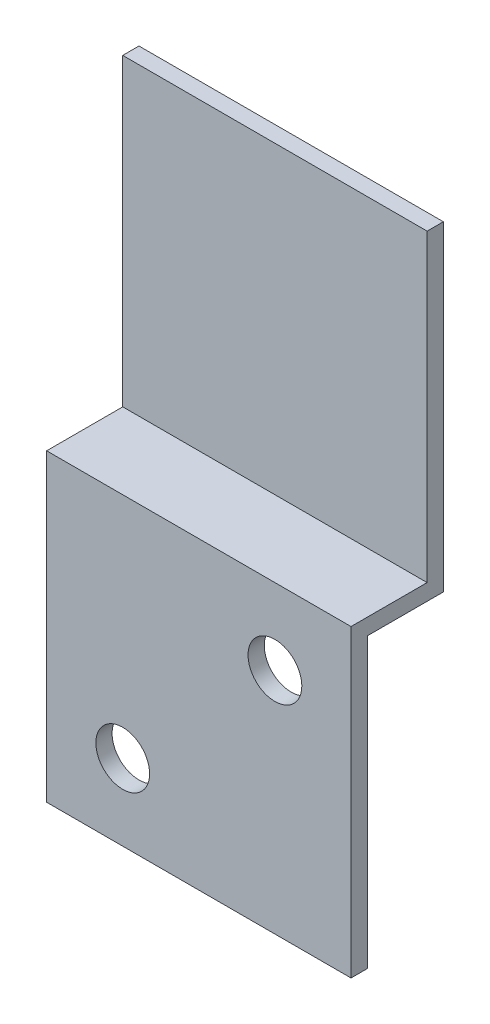
ISO-10303-21;
HEADER;
FILE_DESCRIPTION(('STEP AP214'),'2;1');
FILE_NAME('part.step','',(''),(''),'','','');
FILE_SCHEMA(('AUTOMOTIVE_DESIGN { 1 0 10303 214 1 1 1 1 }'));
ENDSEC;
DATA;
#1=APPLICATION_CONTEXT('core data for automotive mechanical design processes');
#2=APPLICATION_PROTOCOL_DEFINITION('international standard','automotive_design',2000,#1);
#3=PRODUCT_CONTEXT('',#1,'mechanical');
#4=PRODUCT('Part','Part','',(#3));
#5=PRODUCT_RELATED_PRODUCT_CATEGORY('part','',(#4));
#6=PRODUCT_DEFINITION_FORMATION('','',#4);
#7=PRODUCT_DEFINITION_CONTEXT('part definition',#1,'design');
#8=PRODUCT_DEFINITION('design','',#6,#7);
#9=PRODUCT_DEFINITION_SHAPE('','',#8);
#10=(LENGTH_UNIT() NAMED_UNIT(*) SI_UNIT(.MILLI.,.METRE.));
#11=(NAMED_UNIT(*) PLANE_ANGLE_UNIT() SI_UNIT($,.RADIAN.));
#12=(NAMED_UNIT(*) SI_UNIT($,.STERADIAN.) SOLID_ANGLE_UNIT());
#13=UNCERTAINTY_MEASURE_WITH_UNIT(LENGTH_MEASURE(1.E-05),#10,'distance_accuracy_value','');
#14=(GEOMETRIC_REPRESENTATION_CONTEXT(3) GLOBAL_UNCERTAINTY_ASSIGNED_CONTEXT((#13)) GLOBAL_UNIT_ASSIGNED_CONTEXT((#10,
#11,#12)) REPRESENTATION_CONTEXT('',''));
#15=CARTESIAN_POINT('',(0.,0.,0.));
#16=DIRECTION('',(0.,0.,1.));
#17=DIRECTION('',(1.,0.,0.));
#18=AXIS2_PLACEMENT_3D('',#15,#16,#17);
#19=CARTESIAN_POINT('',(38.1,0.,0.));
#20=DIRECTION('',(0.,-1.,0.));
#21=DIRECTION('',(0.,0.,-1.));
#22=AXIS2_PLACEMENT_3D('',#19,#20,#21);
#23=PLANE('',#22);
#24=DIRECTION('',(0.,0.,1.));
#25=VECTOR('',#24,1.);
#26=CARTESIAN_POINT('',(0.,0.,0.));
#27=LINE('',#26,#25);
#28=CARTESIAN_POINT('',(0.,0.,-2.032));
#29=VERTEX_POINT('',#28);
#30=CARTESIAN_POINT('',(0.,0.,0.));
#31=VERTEX_POINT('',#30);
#32=EDGE_CURVE('E131',#29,#31,#27,.T.);
#33=ORIENTED_EDGE('',*,*,#32,.T.);
#34=DIRECTION('',(-1.,0.,0.));
#35=VECTOR('',#34,1.);
#36=CARTESIAN_POINT('',(38.1,0.,0.));
#37=LINE('',#36,#35);
#38=CARTESIAN_POINT('',(38.1,0.,0.));
#39=VERTEX_POINT('',#38);
#40=EDGE_CURVE('E11',#39,#31,#37,.T.);
#41=ORIENTED_EDGE('',*,*,#40,.F.);
#42=DIRECTION('',(0.,0.,1.));
#43=VECTOR('',#42,1.);
#44=CARTESIAN_POINT('',(38.1,0.,0.));
#45=LINE('',#44,#43);
#46=CARTESIAN_POINT('',(38.1,0.,-2.032));
#47=VERTEX_POINT('',#46);
#48=EDGE_CURVE('E145',#47,#39,#45,.T.);
#49=ORIENTED_EDGE('',*,*,#48,.F.);
#50=DIRECTION('',(-1.,0.,0.));
#51=VECTOR('',#50,1.);
#52=CARTESIAN_POINT('',(38.1,0.,-2.032));
#53=LINE('',#52,#51);
#54=EDGE_CURVE('E127',#47,#29,#53,.T.);
#55=ORIENTED_EDGE('',*,*,#54,.T.);
#56=EDGE_LOOP('',(#33,#41,#49,#55));
#57=FACE_BOUND('',#56,.T.);
#58=ADVANCED_FACE('F33',(#57),#23,.F.);
#59=CARTESIAN_POINT('',(38.1,0.,0.));
#60=DIRECTION('',(0.,0.,-1.));
#61=DIRECTION('',(0.,1.,0.));
#62=AXIS2_PLACEMENT_3D('',#59,#60,#61);
#63=PLANE('',#62);
#64=DIRECTION('',(0.,-1.,0.));
#65=VECTOR('',#64,1.);
#66=CARTESIAN_POINT('',(0.,0.,0.));
#67=LINE('',#66,#65);
#68=CARTESIAN_POINT('',(0.,-38.1,0.));
#69=VERTEX_POINT('',#68);
#70=EDGE_CURVE('E134',#31,#69,#67,.T.);
#71=ORIENTED_EDGE('',*,*,#70,.T.);
#72=DIRECTION('',(-1.,0.,0.));
#73=VECTOR('',#72,1.);
#74=CARTESIAN_POINT('',(38.1,-38.1,0.));
#75=LINE('',#74,#73);
#76=CARTESIAN_POINT('',(38.1,-38.1,0.));
#77=VERTEX_POINT('',#76);
#78=EDGE_CURVE('E42',#77,#69,#75,.T.);
#79=ORIENTED_EDGE('',*,*,#78,.F.);
#80=DIRECTION('',(0.,-1.,0.));
#81=VECTOR('',#80,1.);
#82=CARTESIAN_POINT('',(38.1,0.,0.));
#83=LINE('',#82,#81);
#84=EDGE_CURVE('E94',#39,#77,#83,.T.);
#85=ORIENTED_EDGE('',*,*,#84,.F.);
#86=ORIENTED_EDGE('',*,*,#40,.T.);
#87=EDGE_LOOP('',(#71,#79,#85,#86));
#88=FACE_BOUND('',#87,.T.);
#89=ADVANCED_FACE('F203',(#88),#63,.F.);
#90=CARTESIAN_POINT('',(38.1,-38.1,0.));
#91=DIRECTION('',(0.,-1.,0.));
#92=DIRECTION('',(0.,0.,-1.));
#93=AXIS2_PLACEMENT_3D('',#90,#91,#92);
#94=PLANE('',#93);
#95=DIRECTION('',(0.,0.,1.));
#96=VECTOR('',#95,1.);
#97=CARTESIAN_POINT('',(0.,-38.1,0.));
#98=LINE('',#97,#96);
#99=CARTESIAN_POINT('',(0.,-38.1,9.525));
#100=VERTEX_POINT('',#99);
#101=EDGE_CURVE('E136',#69,#100,#98,.T.);
#102=ORIENTED_EDGE('',*,*,#101,.T.);
#103=DIRECTION('',(-1.,0.,0.));
#104=VECTOR('',#103,1.);
#105=CARTESIAN_POINT('',(38.1,-38.1,9.525));
#106=LINE('',#105,#104);
#107=CARTESIAN_POINT('',(38.1,-38.1,9.525));
#108=VERTEX_POINT('',#107);
#109=EDGE_CURVE('E152',#108,#100,#106,.T.);
#110=ORIENTED_EDGE('',*,*,#109,.F.);
#111=DIRECTION('',(0.,0.,1.));
#112=VECTOR('',#111,1.);
#113=CARTESIAN_POINT('',(38.1,-38.1,0.));
#114=LINE('',#113,#112);
#115=EDGE_CURVE('E172',#77,#108,#114,.T.);
#116=ORIENTED_EDGE('',*,*,#115,.F.);
#117=ORIENTED_EDGE('',*,*,#78,.T.);
#118=EDGE_LOOP('',(#102,#110,#116,#117));
#119=FACE_BOUND('',#118,.T.);
#120=ADVANCED_FACE('F207',(#119),#94,.F.);
#121=CARTESIAN_POINT('',(38.1,-38.1,9.525));
#122=DIRECTION('',(0.,0.,-1.));
#123=DIRECTION('',(0.,1.,0.));
#124=AXIS2_PLACEMENT_3D('',#121,#122,#123);
#125=PLANE('',#124);
#126=CARTESIAN_POINT('',(9.525,-66.675,9.52500000000001));
#127=DIRECTION('',(0.,0.,1.));
#128=DIRECTION('',(1.,0.,0.));
#129=AXIS2_PLACEMENT_3D('',#126,#127,#128);
#130=CIRCLE('',#129,3.3655);
#131=CARTESIAN_POINT('',(12.8905,-66.675,9.52500000000001));
#132=VERTEX_POINT('',#131);
#133=EDGE_CURVE('E158',#132,#132,#130,.T.);
#134=ORIENTED_EDGE('',*,*,#133,.F.);
#135=EDGE_LOOP('',(#134));
#136=FACE_BOUND('',#135,.T.);
#137=CARTESIAN_POINT('',(28.575,-47.625,9.52500000000001));
#138=DIRECTION('',(0.,0.,1.));
#139=DIRECTION('',(1.,0.,0.));
#140=AXIS2_PLACEMENT_3D('',#137,#138,#139);
#141=CIRCLE('',#140,3.36549999999999);
#142=CARTESIAN_POINT('',(31.9405,-47.625,9.52500000000001));
#143=VERTEX_POINT('',#142);
#144=EDGE_CURVE('E163',#143,#143,#141,.T.);
#145=ORIENTED_EDGE('',*,*,#144,.F.);
#146=EDGE_LOOP('',(#145));
#147=FACE_BOUND('',#146,.T.);
#148=DIRECTION('',(0.,-1.,0.));
#149=VECTOR('',#148,1.);
#150=CARTESIAN_POINT('',(0.,-38.1,9.525));
#151=LINE('',#150,#149);
#152=CARTESIAN_POINT('',(0.,-76.2,9.52499999999999));
#153=VERTEX_POINT('',#152);
#154=EDGE_CURVE('E138',#100,#153,#151,.T.);
#155=ORIENTED_EDGE('',*,*,#154,.T.);
#156=DIRECTION('',(-1.,0.,0.));
#157=VECTOR('',#156,1.);
#158=CARTESIAN_POINT('',(38.1,-76.2,9.52499999999999));
#159=LINE('',#158,#157);
#160=CARTESIAN_POINT('',(38.1,-76.2,9.52499999999999));
#161=VERTEX_POINT('',#160);
#162=EDGE_CURVE('E149',#161,#153,#159,.T.);
#163=ORIENTED_EDGE('',*,*,#162,.F.);
#164=DIRECTION('',(0.,-1.,0.));
#165=VECTOR('',#164,1.);
#166=CARTESIAN_POINT('',(38.1,-38.1,9.525));
#167=LINE('',#166,#165);
#168=EDGE_CURVE('E174',#108,#161,#167,.T.);
#169=ORIENTED_EDGE('',*,*,#168,.F.);
#170=ORIENTED_EDGE('',*,*,#109,.T.);
#171=EDGE_LOOP('',(#155,#163,#169,#170));
#172=FACE_BOUND('',#171,.T.);
#173=ADVANCED_FACE('F180',(#136,#147,#172),#125,.F.);
#174=CARTESIAN_POINT('',(38.1,-76.2,9.52499999999999));
#175=DIRECTION('',(0.,1.,0.));
#176=DIRECTION('',(0.,0.,1.));
#177=AXIS2_PLACEMENT_3D('',#174,#175,#176);
#178=PLANE('',#177);
#179=DIRECTION('',(0.,0.,-1.));
#180=VECTOR('',#179,1.);
#181=CARTESIAN_POINT('',(0.,-76.2,9.52499999999999));
#182=LINE('',#181,#180);
#183=CARTESIAN_POINT('',(0.,-76.2,7.49299999999999));
#184=VERTEX_POINT('',#183);
#185=EDGE_CURVE('E140',#153,#184,#182,.T.);
#186=ORIENTED_EDGE('',*,*,#185,.T.);
#187=DIRECTION('',(-1.,0.,0.));
#188=VECTOR('',#187,1.);
#189=CARTESIAN_POINT('',(38.1,-76.2,7.49299999999999));
#190=LINE('',#189,#188);
#191=CARTESIAN_POINT('',(38.1,-76.2,7.49299999999999));
#192=VERTEX_POINT('',#191);
#193=EDGE_CURVE('E122',#192,#184,#190,.T.);
#194=ORIENTED_EDGE('',*,*,#193,.F.);
#195=DIRECTION('',(0.,0.,-1.));
#196=VECTOR('',#195,1.);
#197=CARTESIAN_POINT('',(38.1,-76.2,9.52499999999999));
#198=LINE('',#197,#196);
#199=EDGE_CURVE('E113',#161,#192,#198,.T.);
#200=ORIENTED_EDGE('',*,*,#199,.F.);
#201=ORIENTED_EDGE('',*,*,#162,.T.);
#202=EDGE_LOOP('',(#186,#194,#200,#201));
#203=FACE_BOUND('',#202,.T.);
#204=ADVANCED_FACE('F184',(#203),#178,.F.);
#205=CARTESIAN_POINT('',(38.1,-40.132,7.493));
#206=DIRECTION('',(0.,0.,1.));
#207=DIRECTION('',(0.,-1.,0.));
#208=AXIS2_PLACEMENT_3D('',#205,#206,#207);
#209=PLANE('',#208);
#210=CARTESIAN_POINT('',(9.525,-66.675,7.49299999999999));
#211=DIRECTION('',(0.,0.,1.));
#212=DIRECTION('',(0.,-1.,0.));
#213=AXIS2_PLACEMENT_3D('',#210,#211,#212);
#214=CIRCLE('',#213,3.3655);
#215=CARTESIAN_POINT('',(9.525,-70.0405,7.49299999999999));
#216=VERTEX_POINT('',#215);
#217=EDGE_CURVE('E36',#216,#216,#214,.T.);
#218=ORIENTED_EDGE('',*,*,#217,.T.);
#219=EDGE_LOOP('',(#218));
#220=FACE_BOUND('',#219,.T.);
#221=CARTESIAN_POINT('',(28.575,-47.625,7.493));
#222=DIRECTION('',(0.,0.,1.));
#223=DIRECTION('',(0.,-1.,0.));
#224=AXIS2_PLACEMENT_3D('',#221,#222,#223);
#225=CIRCLE('',#224,3.36549999999999);
#226=CARTESIAN_POINT('',(28.575,-50.9905,7.49299999999999));
#227=VERTEX_POINT('',#226);
#228=EDGE_CURVE('E156',#227,#227,#225,.T.);
#229=ORIENTED_EDGE('',*,*,#228,.T.);
#230=EDGE_LOOP('',(#229));
#231=FACE_BOUND('',#230,.T.);
#232=DIRECTION('',(0.,1.,0.));
#233=VECTOR('',#232,1.);
#234=CARTESIAN_POINT('',(0.,-40.132,7.493));
#235=LINE('',#234,#233);
#236=CARTESIAN_POINT('',(0.,-40.132,7.493));
#237=VERTEX_POINT('',#236);
#238=EDGE_CURVE('E121',#184,#237,#235,.T.);
#239=ORIENTED_EDGE('',*,*,#238,.T.);
#240=DIRECTION('',(-1.,0.,0.));
#241=VECTOR('',#240,1.);
#242=CARTESIAN_POINT('',(38.1,-40.132,7.493));
#243=LINE('',#242,#241);
#244=CARTESIAN_POINT('',(38.1,-40.132,7.493));
#245=VERTEX_POINT('',#244);
#246=EDGE_CURVE('E118',#245,#237,#243,.T.);
#247=ORIENTED_EDGE('',*,*,#246,.F.);
#248=DIRECTION('',(0.,1.,0.));
#249=VECTOR('',#248,1.);
#250=CARTESIAN_POINT('',(38.1,-40.132,7.493));
#251=LINE('',#250,#249);
#252=EDGE_CURVE('E107',#192,#245,#251,.T.);
#253=ORIENTED_EDGE('',*,*,#252,.F.);
#254=ORIENTED_EDGE('',*,*,#193,.T.);
#255=EDGE_LOOP('',(#239,#247,#253,#254));
#256=FACE_BOUND('',#255,.T.);
#257=ADVANCED_FACE('F119',(#220,#231,#256),#209,.F.);
#258=CARTESIAN_POINT('',(38.1,-40.132,-2.032));
#259=DIRECTION('',(0.,1.,0.));
#260=DIRECTION('',(0.,0.,1.));
#261=AXIS2_PLACEMENT_3D('',#258,#259,#260);
#262=PLANE('',#261);
#263=DIRECTION('',(0.,0.,-1.));
#264=VECTOR('',#263,1.);
#265=CARTESIAN_POINT('',(0.,-40.132,-2.032));
#266=LINE('',#265,#264);
#267=CARTESIAN_POINT('',(0.,-40.132,-2.032));
#268=VERTEX_POINT('',#267);
#269=EDGE_CURVE('E80',#237,#268,#266,.T.);
#270=ORIENTED_EDGE('',*,*,#269,.T.);
#271=DIRECTION('',(-1.,0.,0.));
#272=VECTOR('',#271,1.);
#273=CARTESIAN_POINT('',(38.1,-40.132,-2.032));
#274=LINE('',#273,#272);
#275=CARTESIAN_POINT('',(38.1,-40.132,-2.032));
#276=VERTEX_POINT('',#275);
#277=EDGE_CURVE('E123',#276,#268,#274,.T.);
#278=ORIENTED_EDGE('',*,*,#277,.F.);
#279=DIRECTION('',(0.,0.,-1.));
#280=VECTOR('',#279,1.);
#281=CARTESIAN_POINT('',(38.1,-40.132,-2.032));
#282=LINE('',#281,#280);
#283=EDGE_CURVE('E111',#245,#276,#282,.T.);
#284=ORIENTED_EDGE('',*,*,#283,.F.);
#285=ORIENTED_EDGE('',*,*,#246,.T.);
#286=EDGE_LOOP('',(#270,#278,#284,#285));
#287=FACE_BOUND('',#286,.T.);
#288=ADVANCED_FACE('F125',(#287),#262,.F.);
#289=CARTESIAN_POINT('',(38.1,0.,-2.032));
#290=DIRECTION('',(0.,0.,1.));
#291=DIRECTION('',(0.,-1.,0.));
#292=AXIS2_PLACEMENT_3D('',#289,#290,#291);
#293=PLANE('',#292);
#294=DIRECTION('',(0.,1.,0.));
#295=VECTOR('',#294,1.);
#296=CARTESIAN_POINT('',(0.,0.,-2.032));
#297=LINE('',#296,#295);
#298=EDGE_CURVE('E86',#268,#29,#297,.T.);
#299=ORIENTED_EDGE('',*,*,#298,.T.);
#300=ORIENTED_EDGE('',*,*,#54,.F.);
#301=DIRECTION('',(0.,1.,0.));
#302=VECTOR('',#301,1.);
#303=CARTESIAN_POINT('',(38.1,0.,-2.032));
#304=LINE('',#303,#302);
#305=EDGE_CURVE('E51',#276,#47,#304,.T.);
#306=ORIENTED_EDGE('',*,*,#305,.F.);
#307=ORIENTED_EDGE('',*,*,#277,.T.);
#308=EDGE_LOOP('',(#299,#300,#306,#307));
#309=FACE_BOUND('',#308,.T.);
#310=ADVANCED_FACE('F192',(#309),#293,.F.);
#311=CARTESIAN_POINT('',(38.1,0.,0.));
#312=DIRECTION('',(-1.,0.,0.));
#313=DIRECTION('',(0.,0.,1.));
#314=AXIS2_PLACEMENT_3D('',#311,#312,#313);
#315=PLANE('',#314);
#316=ORIENTED_EDGE('',*,*,#48,.T.);
#317=ORIENTED_EDGE('',*,*,#84,.T.);
#318=ORIENTED_EDGE('',*,*,#115,.T.);
#319=ORIENTED_EDGE('',*,*,#168,.T.);
#320=ORIENTED_EDGE('',*,*,#199,.T.);
#321=ORIENTED_EDGE('',*,*,#252,.T.);
#322=ORIENTED_EDGE('',*,*,#283,.T.);
#323=ORIENTED_EDGE('',*,*,#305,.T.);
#324=EDGE_LOOP('',(#316,#317,#318,#319,#320,#321,#322,#323));
#325=FACE_BOUND('',#324,.T.);
#326=ADVANCED_FACE('F109',(#325),#315,.F.);
#327=CARTESIAN_POINT('',(0.,0.,0.));
#328=DIRECTION('',(-1.,0.,0.));
#329=DIRECTION('',(0.,0.,1.));
#330=AXIS2_PLACEMENT_3D('',#327,#328,#329);
#331=PLANE('',#330);
#332=ORIENTED_EDGE('',*,*,#32,.F.);
#333=ORIENTED_EDGE('',*,*,#298,.F.);
#334=ORIENTED_EDGE('',*,*,#269,.F.);
#335=ORIENTED_EDGE('',*,*,#238,.F.);
#336=ORIENTED_EDGE('',*,*,#185,.F.);
#337=ORIENTED_EDGE('',*,*,#154,.F.);
#338=ORIENTED_EDGE('',*,*,#101,.F.);
#339=ORIENTED_EDGE('',*,*,#70,.F.);
#340=EDGE_LOOP('',(#332,#333,#334,#335,#336,#337,#338,#339));
#341=FACE_BOUND('',#340,.T.);
#342=ADVANCED_FACE('F187',(#341),#331,.T.);
#343=CARTESIAN_POINT('',(28.575,-47.625,-2.032));
#344=DIRECTION('',(0.,0.,1.));
#345=DIRECTION('',(1.,0.,0.));
#346=AXIS2_PLACEMENT_3D('',#343,#344,#345);
#347=CYLINDRICAL_SURFACE('',#346,3.36549999999999);
#348=ORIENTED_EDGE('',*,*,#144,.T.);
#349=EDGE_LOOP('',(#348));
#350=FACE_BOUND('',#349,.T.);
#351=ORIENTED_EDGE('',*,*,#228,.F.);
#352=EDGE_LOOP('',(#351));
#353=FACE_BOUND('',#352,.T.);
#354=ADVANCED_FACE('F227',(#350,#353),#347,.F.);
#355=CARTESIAN_POINT('',(9.525,-66.675,-2.032));
#356=DIRECTION('',(0.,0.,1.));
#357=DIRECTION('',(1.,0.,0.));
#358=AXIS2_PLACEMENT_3D('',#355,#356,#357);
#359=CYLINDRICAL_SURFACE('',#358,3.3655);
#360=ORIENTED_EDGE('',*,*,#133,.T.);
#361=EDGE_LOOP('',(#360));
#362=FACE_BOUND('',#361,.T.);
#363=ORIENTED_EDGE('',*,*,#217,.F.);
#364=EDGE_LOOP('',(#363));
#365=FACE_BOUND('',#364,.T.);
#366=ADVANCED_FACE('F225',(#362,#365),#359,.F.);
#367=CLOSED_SHELL('',(#58,#89,#120,#173,#204,#257,#288,#310,#326,#342,#354,#366));
#368=MANIFOLD_SOLID_BREP('B2',#367);
#369=ADVANCED_BREP_SHAPE_REPRESENTATION('',(#18,#368),#14);
#370=SHAPE_DEFINITION_REPRESENTATION(#9,#369);
ENDSEC;
END-ISO-10303-21;
